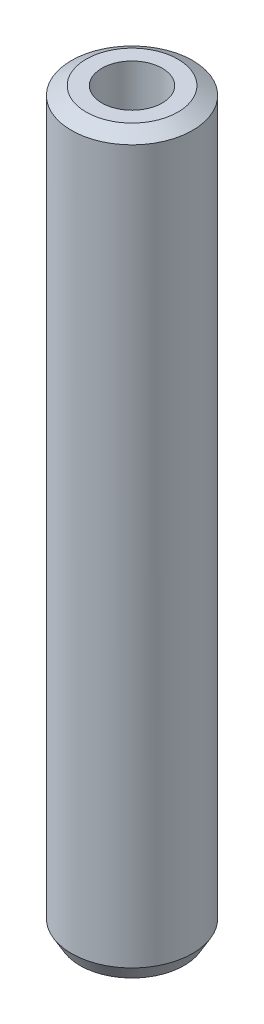
ISO-10303-21;
HEADER;
FILE_DESCRIPTION(('STEP AP214'),'2;1');
FILE_NAME('part.step','',(''),(''),'','','');
FILE_SCHEMA(('AUTOMOTIVE_DESIGN { 1 0 10303 214 1 1 1 1 }'));
ENDSEC;
DATA;
#1=APPLICATION_CONTEXT('core data for automotive mechanical design processes');
#2=APPLICATION_PROTOCOL_DEFINITION('international standard','automotive_design',2000,#1);
#3=PRODUCT_CONTEXT('',#1,'mechanical');
#4=PRODUCT('Part','Part','',(#3));
#5=PRODUCT_RELATED_PRODUCT_CATEGORY('part','',(#4));
#6=PRODUCT_DEFINITION_FORMATION('','',#4);
#7=PRODUCT_DEFINITION_CONTEXT('part definition',#1,'design');
#8=PRODUCT_DEFINITION('design','',#6,#7);
#9=PRODUCT_DEFINITION_SHAPE('','',#8);
#10=(LENGTH_UNIT() NAMED_UNIT(*) SI_UNIT(.MILLI.,.METRE.));
#11=(NAMED_UNIT(*) PLANE_ANGLE_UNIT() SI_UNIT($,.RADIAN.));
#12=(NAMED_UNIT(*) SI_UNIT($,.STERADIAN.) SOLID_ANGLE_UNIT());
#13=UNCERTAINTY_MEASURE_WITH_UNIT(LENGTH_MEASURE(1.E-05),#10,'distance_accuracy_value','');
#14=(GEOMETRIC_REPRESENTATION_CONTEXT(3) GLOBAL_UNCERTAINTY_ASSIGNED_CONTEXT((#13)) GLOBAL_UNIT_ASSIGNED_CONTEXT((#10,
#11,#12)) REPRESENTATION_CONTEXT('',''));
#15=CARTESIAN_POINT('',(0.,0.,0.));
#16=DIRECTION('',(0.,0.,1.));
#17=DIRECTION('',(1.,0.,0.));
#18=AXIS2_PLACEMENT_3D('',#15,#16,#17);
#19=CARTESIAN_POINT('',(0.,212.597942855672,0.));
#20=DIRECTION('',(0.,-1.,0.));
#21=DIRECTION('',(0.,0.,-1.));
#22=AXIS2_PLACEMENT_3D('',#19,#20,#21);
#23=CYLINDRICAL_SURFACE('',#22,17.5);
#24=CARTESIAN_POINT('',(0.,210.147948494886,0.));
#25=DIRECTION('',(0.,1.,0.));
#26=DIRECTION('',(0.,0.,1.));
#27=AXIS2_PLACEMENT_3D('',#24,#25,#26);
#28=CIRCLE('',#27,17.5);
#29=CARTESIAN_POINT('',(0.,210.147948494886,-17.5));
#30=VERTEX_POINT('',#29);
#31=EDGE_CURVE('E50',#30,#30,#28,.F.);
#32=CARTESIAN_POINT('',(0.,4.24351471113849,0.));
#33=DIRECTION('',(0.,1.,0.));
#34=DIRECTION('',(0.,0.,1.));
#35=AXIS2_PLACEMENT_3D('',#32,#33,#34);
#36=CIRCLE('',#35,17.5);
#37=CARTESIAN_POINT('',(0.,4.24351471113846,-17.5));
#38=VERTEX_POINT('',#37);
#39=EDGE_CURVE('E51',#38,#38,#36,.T.);
#40=CARTESIAN_POINT('',(0.,210.147948494886,-17.5));
#41=CARTESIAN_POINT('',(0.,208.003110642972,-17.5));
#42=CARTESIAN_POINT('',(0.,205.858272791058,-17.5));
#43=CARTESIAN_POINT('',(0.,201.56859708723,-17.5));
#44=CARTESIAN_POINT('',(0.,199.423759235316,-17.5));
#45=CARTESIAN_POINT('',(0.,195.134083531488,-17.5));
#46=CARTESIAN_POINT('',(0.,192.989245679574,-17.5));
#47=CARTESIAN_POINT('',(0.,188.699569975746,-17.5));
#48=CARTESIAN_POINT('',(0.,186.554732123832,-17.5));
#49=CARTESIAN_POINT('',(0.,182.265056420004,-17.5));
#50=CARTESIAN_POINT('',(0.,180.12021856809,-17.5));
#51=CARTESIAN_POINT('',(0.,175.830542864262,-17.5));
#52=CARTESIAN_POINT('',(0.,173.685705012347,-17.5));
#53=CARTESIAN_POINT('',(0.,169.396029308519,-17.5));
#54=CARTESIAN_POINT('',(0.,167.251191456605,-17.5));
#55=CARTESIAN_POINT('',(0.,162.961515752777,-17.5));
#56=CARTESIAN_POINT('',(0.,160.816677900863,-17.5));
#57=CARTESIAN_POINT('',(0.,156.527002197035,-17.5));
#58=CARTESIAN_POINT('',(0.,154.382164345121,-17.5));
#59=CARTESIAN_POINT('',(0.,150.092488641293,-17.5));
#60=CARTESIAN_POINT('',(0.,147.947650789379,-17.5));
#61=CARTESIAN_POINT('',(0.,143.657975085551,-17.5));
#62=CARTESIAN_POINT('',(0.,141.513137233637,-17.5));
#63=CARTESIAN_POINT('',(0.,137.223461529809,-17.5));
#64=CARTESIAN_POINT('',(0.,135.078623677895,-17.5));
#65=CARTESIAN_POINT('',(0.,130.788947974067,-17.5));
#66=CARTESIAN_POINT('',(0.,128.644110122153,-17.5));
#67=CARTESIAN_POINT('',(0.,124.354434418325,-17.5));
#68=CARTESIAN_POINT('',(0.,122.209596566411,-17.5));
#69=CARTESIAN_POINT('',(0.,117.919920862582,-17.5));
#70=CARTESIAN_POINT('',(0.,115.775083010668,-17.5));
#71=CARTESIAN_POINT('',(0.,111.48540730684,-17.5));
#72=CARTESIAN_POINT('',(0.,109.340569454926,-17.5));
#73=CARTESIAN_POINT('',(0.,105.050893751098,-17.5));
#74=CARTESIAN_POINT('',(0.,102.906055899184,-17.5));
#75=CARTESIAN_POINT('',(0.,98.6163801953561,-17.5));
#76=CARTESIAN_POINT('',(0.,96.4715423434421,-17.5));
#77=CARTESIAN_POINT('',(0.,92.181866639614,-17.5));
#78=CARTESIAN_POINT('',(0.,90.0370287877,-17.5));
#79=CARTESIAN_POINT('',(0.,85.7473530838719,-17.5));
#80=CARTESIAN_POINT('',(0.,83.6025152319579,-17.5));
#81=CARTESIAN_POINT('',(0.,79.3128395281298,-17.5));
#82=CARTESIAN_POINT('',(0.,77.1680016762158,-17.5));
#83=CARTESIAN_POINT('',(0.,72.8783259723877,-17.5));
#84=CARTESIAN_POINT('',(0.,70.7334881204736,-17.5));
#85=CARTESIAN_POINT('',(0.,66.4438124166456,-17.5));
#86=CARTESIAN_POINT('',(0.,64.2989745647315,-17.5));
#87=CARTESIAN_POINT('',(0.,60.0092988609034,-17.5));
#88=CARTESIAN_POINT('',(0.,57.8644610089894,-17.5));
#89=CARTESIAN_POINT('',(0.,53.5747853051613,-17.5));
#90=CARTESIAN_POINT('',(0.,51.4299474532473,-17.5));
#91=CARTESIAN_POINT('',(0.,47.1402717494192,-17.5));
#92=CARTESIAN_POINT('',(0.,44.9954338975052,-17.5));
#93=CARTESIAN_POINT('',(0.,40.7057581936771,-17.5));
#94=CARTESIAN_POINT('',(0.,38.5609203417631,-17.5));
#95=CARTESIAN_POINT('',(0.,34.271244637935,-17.5));
#96=CARTESIAN_POINT('',(0.,32.126406786021,-17.5));
#97=CARTESIAN_POINT('',(0.,27.8367310821929,-17.5));
#98=CARTESIAN_POINT('',(0.,25.6918932302788,-17.5));
#99=CARTESIAN_POINT('',(0.,21.4022175264508,-17.5));
#100=CARTESIAN_POINT('',(0.,19.2573796745367,-17.5));
#101=CARTESIAN_POINT('',(0.,14.9677039707086,-17.5));
#102=CARTESIAN_POINT('',(0.,12.8228661187946,-17.5));
#103=CARTESIAN_POINT('',(0.,8.53319041496654,-17.5));
#104=CARTESIAN_POINT('',(0.,6.3883525630525,-17.5));
#105=CARTESIAN_POINT('',(0.,4.24351471113846,-17.5));
#106=B_SPLINE_CURVE_WITH_KNOTS('',3,(#40,#41,#42,#43,#44,#45,#46,#47,#48,#49,#50,#51,#52,#53,
#54,#55,#56,#57,#58,#59,#60,#61,#62,#63,#64,#65,#66,#67,#68,#69,#70,#71,#72,#73,#74,#75,#76,#77,
#78,#79,#80,#81,#82,#83,#84,#85,#86,#87,#88,#89,#90,#91,#92,#93,#94,#95,#96,#97,#98,#99,#100,
#101,#102,#103,#104,#105),.UNSPECIFIED.,.F.,.F.,(4,2,2,2,2,2,2,2,2,2,2,2,2,2,2,2,2,2,2,2,2,2,2,
2,2,2,2,2,2,2,2,2,4),(0.,6.43451355574209,12.8690271114842,19.3035406672263,25.7380542229684,
32.1725677787106,38.6070813344526,45.0415948901948,51.4761084459369,57.910622001679,
64.3451355574211,70.7796491131632,77.2141626689053,83.6486762246475,90.0831897803896,
96.5177033361317,102.952216891874,109.386730447616,115.821244003358,122.2557575591,
128.690271114842,135.124784670584,141.559298226326,147.993811782069,154.428325337811,
160.862838893553,167.297352449295,173.731866005037,180.166379560779,186.600893116521,
193.035406672263,199.469920228005,205.904433783748),.UNSPECIFIED.);
#107=EDGE_CURVE('BSEAM39',#30,#38,#106,.T.);
#108=ORIENTED_EDGE('',*,*,#31,.T.);
#109=ORIENTED_EDGE('',*,*,#39,.T.);
#110=ORIENTED_EDGE('',*,*,#107,.T.);
#111=ORIENTED_EDGE('',*,*,#107,.F.);
#112=EDGE_LOOP('',(#108,#110,#109,#111));
#113=FACE_BOUND('',#112,.T.);
#114=ADVANCED_FACE('F39',(#113),#23,.T.);
#115=CARTESIAN_POINT('',(0.,212.597942855672,0.));
#116=DIRECTION('',(0.,1.,0.));
#117=DIRECTION('',(0.,0.,1.));
#118=AXIS2_PLACEMENT_3D('',#115,#116,#117);
#119=PLANE('',#118);
#120=CARTESIAN_POINT('',(0.,212.597942855672,0.));
#121=DIRECTION('',(0.,1.,0.));
#122=DIRECTION('',(0.,0.,1.));
#123=AXIS2_PLACEMENT_3D('',#120,#121,#122);
#124=CIRCLE('',#123,13.2564852888617);
#125=CARTESIAN_POINT('',(0.,212.597942855672,13.2564852888617));
#126=VERTEX_POINT('',#125);
#127=EDGE_CURVE('E54',#126,#126,#124,.T.);
#128=ORIENTED_EDGE('',*,*,#127,.T.);
#129=EDGE_LOOP('',(#128));
#130=FACE_BOUND('',#129,.T.);
#131=CARTESIAN_POINT('',(0.,212.597942855672,0.));
#132=DIRECTION('',(0.,1.,0.));
#133=DIRECTION('',(0.,0.,1.));
#134=AXIS2_PLACEMENT_3D('',#131,#132,#133);
#135=CIRCLE('',#134,8.72102797390348);
#136=CARTESIAN_POINT('',(0.,212.597942855672,-8.72102797390348));
#137=VERTEX_POINT('',#136);
#138=EDGE_CURVE('E58',#137,#137,#135,.T.);
#139=ORIENTED_EDGE('',*,*,#138,.F.);
#140=EDGE_LOOP('',(#139));
#141=FACE_BOUND('',#140,.T.);
#142=ADVANCED_FACE('F69',(#130,#141),#119,.T.);
#143=CARTESIAN_POINT('',(0.,0.,0.));
#144=DIRECTION('',(0.,1.,0.));
#145=DIRECTION('',(0.,0.,1.));
#146=AXIS2_PLACEMENT_3D('',#143,#144,#145);
#147=PLANE('',#146);
#148=CARTESIAN_POINT('',(0.,0.,0.));
#149=DIRECTION('',(0.,1.,0.));
#150=DIRECTION('',(0.,0.,1.));
#151=AXIS2_PLACEMENT_3D('',#148,#149,#150);
#152=CIRCLE('',#151,15.050005639214);
#153=CARTESIAN_POINT('',(0.,0.,15.050005639214));
#154=VERTEX_POINT('',#153);
#155=EDGE_CURVE('E10',#154,#154,#152,.F.);
#156=ORIENTED_EDGE('',*,*,#155,.T.);
#157=EDGE_LOOP('',(#156));
#158=FACE_BOUND('',#157,.T.);
#159=CARTESIAN_POINT('',(0.,0.,0.));
#160=DIRECTION('',(0.,1.,0.));
#161=DIRECTION('',(0.,0.,1.));
#162=AXIS2_PLACEMENT_3D('',#159,#160,#161);
#163=CIRCLE('',#162,8.72102797390348);
#164=CARTESIAN_POINT('',(0.,0.,-8.72102797390348));
#165=VERTEX_POINT('',#164);
#166=EDGE_CURVE('E63',#165,#165,#163,.T.);
#167=ORIENTED_EDGE('',*,*,#166,.T.);
#168=EDGE_LOOP('',(#167));
#169=FACE_BOUND('',#168,.T.);
#170=ADVANCED_FACE('F75',(#158,#169),#147,.F.);
#171=CARTESIAN_POINT('',(0.,212.597942855672,0.));
#172=DIRECTION('',(0.,-1.,0.));
#173=DIRECTION('',(0.,0.,-1.));
#174=AXIS2_PLACEMENT_3D('',#171,#172,#173);
#175=CYLINDRICAL_SURFACE('',#174,8.72102797390348);
#176=CARTESIAN_POINT('',(0.,212.597942855672,-8.72102797390348));
#177=CARTESIAN_POINT('',(0.,210.383380950925,-8.72102797390348));
#178=CARTESIAN_POINT('',(0.,208.168819046179,-8.72102797390348));
#179=CARTESIAN_POINT('',(0.,203.739695236686,-8.72102797390348));
#180=CARTESIAN_POINT('',(0.,201.525133331939,-8.72102797390348));
#181=CARTESIAN_POINT('',(0.,197.096009522446,-8.72102797390348));
#182=CARTESIAN_POINT('',(0.,194.881447617699,-8.72102797390348));
#183=CARTESIAN_POINT('',(0.,190.452323808206,-8.72102797390348));
#184=CARTESIAN_POINT('',(0.,188.237761903459,-8.72102797390348));
#185=CARTESIAN_POINT('',(0.,183.808638093966,-8.72102797390348));
#186=CARTESIAN_POINT('',(0.,181.59407618922,-8.72102797390348));
#187=CARTESIAN_POINT('',(0.,177.164952379727,-8.72102797390348));
#188=CARTESIAN_POINT('',(0.,174.95039047498,-8.72102797390348));
#189=CARTESIAN_POINT('',(0.,170.521266665487,-8.72102797390348));
#190=CARTESIAN_POINT('',(0.,168.30670476074,-8.72102797390348));
#191=CARTESIAN_POINT('',(0.,163.877580951247,-8.72102797390348));
#192=CARTESIAN_POINT('',(0.,161.6630190465,-8.72102797390348));
#193=CARTESIAN_POINT('',(0.,157.233895237007,-8.72102797390348));
#194=CARTESIAN_POINT('',(0.,155.019333332261,-8.72102797390348));
#195=CARTESIAN_POINT('',(0.,150.590209522768,-8.72102797390348));
#196=CARTESIAN_POINT('',(0.,148.375647618021,-8.72102797390348));
#197=CARTESIAN_POINT('',(0.,143.946523808528,-8.72102797390348));
#198=CARTESIAN_POINT('',(0.,141.731961903781,-8.72102797390348));
#199=CARTESIAN_POINT('',(0.,137.302838094288,-8.72102797390348));
#200=CARTESIAN_POINT('',(0.,135.088276189541,-8.72102797390348));
#201=CARTESIAN_POINT('',(0.,130.659152380048,-8.72102797390348));
#202=CARTESIAN_POINT('',(0.,128.444590475302,-8.72102797390348));
#203=CARTESIAN_POINT('',(0.,124.015466665809,-8.72102797390348));
#204=CARTESIAN_POINT('',(0.,121.800904761062,-8.72102797390348));
#205=CARTESIAN_POINT('',(0.,117.371780951569,-8.72102797390348));
#206=CARTESIAN_POINT('',(0.,115.157219046822,-8.72102797390348));
#207=CARTESIAN_POINT('',(0.,110.728095237329,-8.72102797390348));
#208=CARTESIAN_POINT('',(0.,108.513533332583,-8.72102797390348));
#209=CARTESIAN_POINT('',(0.,104.084409523089,-8.72102797390348));
#210=CARTESIAN_POINT('',(0.,101.869847618343,-8.72102797390348));
#211=CARTESIAN_POINT('',(0.,97.4407238088496,-8.72102797390348));
#212=CARTESIAN_POINT('',(0.,95.226161904103,-8.72102797390348));
#213=CARTESIAN_POINT('',(0.,90.7970380946099,-8.72102797390348));
#214=CARTESIAN_POINT('',(0.,88.5824761898633,-8.72102797390348));
#215=CARTESIAN_POINT('',(0.,84.1533523803701,-8.72102797390348));
#216=CARTESIAN_POINT('',(0.,81.9387904756235,-8.72102797390348));
#217=CARTESIAN_POINT('',(0.,77.5096666661304,-8.72102797390348));
#218=CARTESIAN_POINT('',(0.,75.2951047613838,-8.72102797390348));
#219=CARTESIAN_POINT('',(0.,70.8659809518906,-8.72102797390348));
#220=CARTESIAN_POINT('',(0.,68.651419047144,-8.72102797390348));
#221=CARTESIAN_POINT('',(0.,64.2222952376509,-8.72102797390348));
#222=CARTESIAN_POINT('',(0.,62.0077333329043,-8.72102797390348));
#223=CARTESIAN_POINT('',(0.,57.5786095234111,-8.72102797390348));
#224=CARTESIAN_POINT('',(0.,55.3640476186645,-8.72102797390348));
#225=CARTESIAN_POINT('',(0.,50.9349238091714,-8.72102797390348));
#226=CARTESIAN_POINT('',(0.,48.7203619044248,-8.72102797390348));
#227=CARTESIAN_POINT('',(0.,44.2912380949316,-8.72102797390348));
#228=CARTESIAN_POINT('',(0.,42.076676190185,-8.72102797390348));
#229=CARTESIAN_POINT('',(0.,37.6475523806919,-8.72102797390348));
#230=CARTESIAN_POINT('',(0.,35.4329904759453,-8.72102797390348));
#231=CARTESIAN_POINT('',(0.,31.0038666664521,-8.72102797390348));
#232=CARTESIAN_POINT('',(0.,28.7893047617055,-8.72102797390348));
#233=CARTESIAN_POINT('',(0.,24.3601809522124,-8.72102797390348));
#234=CARTESIAN_POINT('',(0.,22.1456190474658,-8.72102797390348));
#235=CARTESIAN_POINT('',(0.,17.7164952379726,-8.72102797390348));
#236=CARTESIAN_POINT('',(0.,15.5019333332261,-8.72102797390348));
#237=CARTESIAN_POINT('',(0.,11.0728095237329,-8.72102797390348));
#238=CARTESIAN_POINT('',(0.,8.85824761898631,-8.72102797390348));
#239=CARTESIAN_POINT('',(0.,4.42912380949315,-8.72102797390348));
#240=CARTESIAN_POINT('',(0.,2.21456190474656,-8.72102797390348));
#241=CARTESIAN_POINT('',(0.,0.,-8.72102797390348));
#242=B_SPLINE_CURVE_WITH_KNOTS('',3,(#176,#177,#178,#179,#180,#181,#182,#183,#184,#185,#186,
#187,#188,#189,#190,#191,#192,#193,#194,#195,#196,#197,#198,#199,#200,#201,#202,#203,#204,#205,
#206,#207,#208,#209,#210,#211,#212,#213,#214,#215,#216,#217,#218,#219,#220,#221,#222,#223,#224,
#225,#226,#227,#228,#229,#230,#231,#232,#233,#234,#235,#236,#237,#238,#239,#240,#241),
.UNSPECIFIED.,.F.,.F.,(4,2,2,2,2,2,2,2,2,2,2,2,2,2,2,2,2,2,2,2,2,2,2,2,2,2,2,2,2,2,2,2,4),(0.,
6.64368571423976,13.2873714284795,19.9310571427193,26.574742856959,33.2184285711987,
39.8621142854385,46.5057999996782,53.149485713918,59.7931714281577,66.4368571423975,
73.0805428566372,79.724228570877,86.3679142851168,93.0115999993565,99.6552857135962,
106.298971427836,112.942657142076,119.586342856315,126.230028570555,132.873714284795,
139.517399999035,146.161085713274,152.804771427514,159.448457141754,166.092142855994,
172.735828570233,179.379514284473,186.023199998713,192.666885712953,199.310571427192,
205.954257141432,212.597942855672),.UNSPECIFIED.);
#243=EDGE_CURVE('BSEAM70',#137,#165,#242,.T.);
#244=ORIENTED_EDGE('',*,*,#138,.T.);
#245=ORIENTED_EDGE('',*,*,#166,.F.);
#246=ORIENTED_EDGE('',*,*,#243,.T.);
#247=ORIENTED_EDGE('',*,*,#243,.F.);
#248=EDGE_LOOP('',(#244,#246,#245,#247));
#249=FACE_BOUND('',#248,.T.);
#250=ADVANCED_FACE('F70',(#249),#175,.F.);
#251=CARTESIAN_POINT('',(0.,212.597942855672,0.));
#252=DIRECTION('',(0.,-1.,0.));
#253=DIRECTION('',(0.,0.,-1.));
#254=AXIS2_PLACEMENT_3D('',#251,#252,#253);
#255=CONICAL_SURFACE('',#254,13.2564852888617,1.0471975511966);
#256=ORIENTED_EDGE('',*,*,#31,.F.);
#257=EDGE_LOOP('',(#256));
#258=FACE_BOUND('',#257,.T.);
#259=ORIENTED_EDGE('',*,*,#127,.F.);
#260=EDGE_LOOP('',(#259));
#261=FACE_BOUND('',#260,.T.);
#262=ADVANCED_FACE('F81',(#258,#261),#255,.T.);
#263=CARTESIAN_POINT('',(0.,4.24351471113849,0.));
#264=DIRECTION('',(0.,1.,0.));
#265=DIRECTION('',(0.,0.,1.));
#266=AXIS2_PLACEMENT_3D('',#263,#264,#265);
#267=CONICAL_SURFACE('',#266,17.5,0.523598775598305);
#268=ORIENTED_EDGE('',*,*,#155,.F.);
#269=EDGE_LOOP('',(#268));
#270=FACE_BOUND('',#269,.T.);
#271=ORIENTED_EDGE('',*,*,#39,.F.);
#272=EDGE_LOOP('',(#271));
#273=FACE_BOUND('',#272,.T.);
#274=ADVANCED_FACE('F45',(#270,#273),#267,.T.);
#275=CLOSED_SHELL('',(#114,#142,#170,#250,#262,#274));
#276=MANIFOLD_SOLID_BREP('B2',#275);
#277=ADVANCED_BREP_SHAPE_REPRESENTATION('',(#18,#276),#14);
#278=SHAPE_DEFINITION_REPRESENTATION(#9,#277);
ENDSEC;
END-ISO-10303-21;
